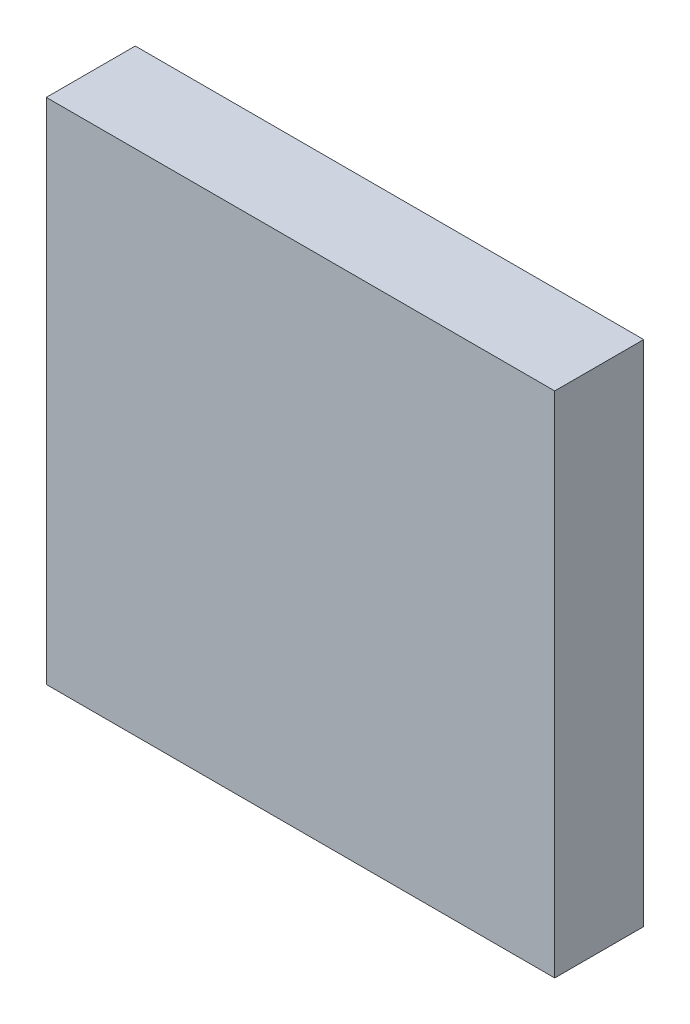
ISO-10303-21;
HEADER;
FILE_DESCRIPTION(('STEP AP214'),'2;1');
FILE_NAME('part.step','',(''),(''),'','','');
FILE_SCHEMA(('AUTOMOTIVE_DESIGN { 1 0 10303 214 1 1 1 1 }'));
ENDSEC;
DATA;
#1=APPLICATION_CONTEXT('core data for automotive mechanical design processes');
#2=APPLICATION_PROTOCOL_DEFINITION('international standard','automotive_design',2000,#1);
#3=PRODUCT_CONTEXT('',#1,'mechanical');
#4=PRODUCT('Part','Part','',(#3));
#5=PRODUCT_RELATED_PRODUCT_CATEGORY('part','',(#4));
#6=PRODUCT_DEFINITION_FORMATION('','',#4);
#7=PRODUCT_DEFINITION_CONTEXT('part definition',#1,'design');
#8=PRODUCT_DEFINITION('design','',#6,#7);
#9=PRODUCT_DEFINITION_SHAPE('','',#8);
#10=(LENGTH_UNIT() NAMED_UNIT(*) SI_UNIT(.MILLI.,.METRE.));
#11=(NAMED_UNIT(*) PLANE_ANGLE_UNIT() SI_UNIT($,.RADIAN.));
#12=(NAMED_UNIT(*) SI_UNIT($,.STERADIAN.) SOLID_ANGLE_UNIT());
#13=UNCERTAINTY_MEASURE_WITH_UNIT(LENGTH_MEASURE(1.E-05),#10,'distance_accuracy_value','');
#14=(GEOMETRIC_REPRESENTATION_CONTEXT(3) GLOBAL_UNCERTAINTY_ASSIGNED_CONTEXT((#13)) GLOBAL_UNIT_ASSIGNED_CONTEXT((#10,
#11,#12)) REPRESENTATION_CONTEXT('',''));
#15=CARTESIAN_POINT('',(0.,0.,0.));
#16=DIRECTION('',(0.,0.,1.));
#17=DIRECTION('',(1.,0.,0.));
#18=AXIS2_PLACEMENT_3D('',#15,#16,#17);
#19=CARTESIAN_POINT('',(-1000.,-1.11022302462516E-13,300.));
#20=DIRECTION('',(1.,0.,0.));
#21=DIRECTION('',(0.,1.,0.));
#22=AXIS2_PLACEMENT_3D('',#19,#20,#21);
#23=PLANE('',#22);
#24=DIRECTION('',(0.,-1.,0.));
#25=VECTOR('',#24,1.);
#26=CARTESIAN_POINT('',(-1000.,-1.11022302462516E-13,0.));
#27=LINE('',#26,#25);
#28=CARTESIAN_POINT('',(-1000.,1000.,0.));
#29=VERTEX_POINT('',#28);
#30=CARTESIAN_POINT('',(-999.999999999999,-1000.,0.));
#31=VERTEX_POINT('',#30);
#32=EDGE_CURVE('E408',#29,#31,#27,.T.);
#33=ORIENTED_EDGE('',*,*,#32,.T.);
#34=DIRECTION('',(0.,0.,-1.));
#35=VECTOR('',#34,1.);
#36=CARTESIAN_POINT('',(-999.999999999999,-1000.,300.));
#37=LINE('',#36,#35);
#38=CARTESIAN_POINT('',(-999.999999999999,-1000.,350.));
#39=VERTEX_POINT('',#38);
#40=EDGE_CURVE('E420',#39,#31,#37,.T.);
#41=ORIENTED_EDGE('',*,*,#40,.F.);
#42=DIRECTION('',(0.,-1.,0.));
#43=VECTOR('',#42,1.);
#44=CARTESIAN_POINT('',(-1000.,1000.,350.));
#45=LINE('',#44,#43);
#46=CARTESIAN_POINT('',(-1000.,1000.,350.));
#47=VERTEX_POINT('',#46);
#48=EDGE_CURVE('E300',#47,#39,#45,.T.);
#49=ORIENTED_EDGE('',*,*,#48,.F.);
#50=DIRECTION('',(0.,0.,-1.));
#51=VECTOR('',#50,1.);
#52=CARTESIAN_POINT('',(-1000.,1000.,300.));
#53=LINE('',#52,#51);
#54=EDGE_CURVE('E295',#47,#29,#53,.T.);
#55=ORIENTED_EDGE('',*,*,#54,.T.);
#56=EDGE_LOOP('',(#33,#41,#49,#55));
#57=FACE_BOUND('',#56,.T.);
#58=ADVANCED_FACE('F91',(#57),#23,.F.);
#59=CARTESIAN_POINT('',(0.,-1000.,300.));
#60=DIRECTION('',(0.,1.,0.));
#61=DIRECTION('',(0.,0.,1.));
#62=AXIS2_PLACEMENT_3D('',#59,#60,#61);
#63=PLANE('',#62);
#64=DIRECTION('',(1.,0.,0.));
#65=VECTOR('',#64,1.);
#66=CARTESIAN_POINT('',(0.,-1000.,0.));
#67=LINE('',#66,#65);
#68=CARTESIAN_POINT('',(1000.,-1000.,0.));
#69=VERTEX_POINT('',#68);
#70=EDGE_CURVE('E412',#31,#69,#67,.T.);
#71=ORIENTED_EDGE('',*,*,#70,.T.);
#72=DIRECTION('',(0.,0.,-1.));
#73=VECTOR('',#72,1.);
#74=CARTESIAN_POINT('',(1000.,-1000.,300.));
#75=LINE('',#74,#73);
#76=CARTESIAN_POINT('',(1000.,-1000.,350.));
#77=VERTEX_POINT('',#76);
#78=EDGE_CURVE('E289',#77,#69,#75,.T.);
#79=ORIENTED_EDGE('',*,*,#78,.F.);
#80=DIRECTION('',(1.,0.,0.));
#81=VECTOR('',#80,1.);
#82=CARTESIAN_POINT('',(-999.999999999999,-1000.,350.));
#83=LINE('',#82,#81);
#84=EDGE_CURVE('E305',#39,#77,#83,.T.);
#85=ORIENTED_EDGE('',*,*,#84,.F.);
#86=ORIENTED_EDGE('',*,*,#40,.T.);
#87=EDGE_LOOP('',(#71,#79,#85,#86));
#88=FACE_BOUND('',#87,.T.);
#89=ADVANCED_FACE('F697',(#88),#63,.F.);
#90=CARTESIAN_POINT('',(1000.,1.11022302462516E-13,300.));
#91=DIRECTION('',(1.,0.,0.));
#92=DIRECTION('',(0.,1.,0.));
#93=AXIS2_PLACEMENT_3D('',#90,#91,#92);
#94=PLANE('',#93);
#95=DIRECTION('',(0.,-1.,0.));
#96=VECTOR('',#95,1.);
#97=CARTESIAN_POINT('',(1000.,1.11022302462516E-13,0.));
#98=LINE('',#97,#96);
#99=CARTESIAN_POINT('',(1000.,1000.,0.));
#100=VERTEX_POINT('',#99);
#101=EDGE_CURVE('E284',#100,#69,#98,.T.);
#102=ORIENTED_EDGE('',*,*,#101,.F.);
#103=DIRECTION('',(0.,0.,-1.));
#104=VECTOR('',#103,1.);
#105=CARTESIAN_POINT('',(1000.,1000.,300.));
#106=LINE('',#105,#104);
#107=CARTESIAN_POINT('',(1000.,1000.,350.));
#108=VERTEX_POINT('',#107);
#109=EDGE_CURVE('E278',#108,#100,#106,.T.);
#110=ORIENTED_EDGE('',*,*,#109,.F.);
#111=DIRECTION('',(0.,1.,0.));
#112=VECTOR('',#111,1.);
#113=CARTESIAN_POINT('',(1000.,-1000.,350.));
#114=LINE('',#113,#112);
#115=EDGE_CURVE('E282',#77,#108,#114,.T.);
#116=ORIENTED_EDGE('',*,*,#115,.F.);
#117=ORIENTED_EDGE('',*,*,#78,.T.);
#118=EDGE_LOOP('',(#102,#110,#116,#117));
#119=FACE_BOUND('',#118,.T.);
#120=ADVANCED_FACE('F280',(#119),#94,.T.);
#121=CARTESIAN_POINT('',(0.,1000.,300.));
#122=DIRECTION('',(0.,1.,0.));
#123=DIRECTION('',(0.,0.,1.));
#124=AXIS2_PLACEMENT_3D('',#121,#122,#123);
#125=PLANE('',#124);
#126=DIRECTION('',(1.,0.,0.));
#127=VECTOR('',#126,1.);
#128=CARTESIAN_POINT('',(0.,1000.,0.));
#129=LINE('',#128,#127);
#130=EDGE_CURVE('E405',#29,#100,#129,.T.);
#131=ORIENTED_EDGE('',*,*,#130,.F.);
#132=ORIENTED_EDGE('',*,*,#54,.F.);
#133=DIRECTION('',(-1.,0.,0.));
#134=VECTOR('',#133,1.);
#135=CARTESIAN_POINT('',(1000.,1000.,350.));
#136=LINE('',#135,#134);
#137=EDGE_CURVE('E293',#108,#47,#136,.T.);
#138=ORIENTED_EDGE('',*,*,#137,.F.);
#139=ORIENTED_EDGE('',*,*,#109,.T.);
#140=EDGE_LOOP('',(#131,#132,#138,#139));
#141=FACE_BOUND('',#140,.T.);
#142=ADVANCED_FACE('F294',(#141),#125,.T.);
#143=CARTESIAN_POINT('',(950.,1.11022302462516E-13,300.));
#144=DIRECTION('',(1.,0.,0.));
#145=DIRECTION('',(0.,1.,0.));
#146=AXIS2_PLACEMENT_3D('',#143,#144,#145);
#147=PLANE('',#146);
#148=DIRECTION('',(0.,-1.,0.));
#149=VECTOR('',#148,1.);
#150=CARTESIAN_POINT('',(950.,1.11022302462516E-13,0.));
#151=LINE('',#150,#149);
#152=CARTESIAN_POINT('',(950.,950.,0.));
#153=VERTEX_POINT('',#152);
#154=CARTESIAN_POINT('',(950.,650.,0.));
#155=VERTEX_POINT('',#154);
#156=EDGE_CURVE('E398',#153,#155,#151,.T.);
#157=ORIENTED_EDGE('',*,*,#156,.T.);
#158=DIRECTION('',(0.,0.,-1.));
#159=VECTOR('',#158,1.);
#160=CARTESIAN_POINT('',(950.,650.,300.));
#161=LINE('',#160,#159);
#162=CARTESIAN_POINT('',(950.,650.,300.));
#163=VERTEX_POINT('',#162);
#164=EDGE_CURVE('E434',#163,#155,#161,.T.);
#165=ORIENTED_EDGE('',*,*,#164,.F.);
#166=DIRECTION('',(0.,-1.,0.));
#167=VECTOR('',#166,1.);
#168=CARTESIAN_POINT('',(950.,1.11022302462516E-13,300.));
#169=LINE('',#168,#167);
#170=CARTESIAN_POINT('',(950.,950.,300.));
#171=VERTEX_POINT('',#170);
#172=EDGE_CURVE('E350',#171,#163,#169,.T.);
#173=ORIENTED_EDGE('',*,*,#172,.F.);
#174=DIRECTION('',(0.,0.,-1.));
#175=VECTOR('',#174,1.);
#176=CARTESIAN_POINT('',(950.,950.,300.));
#177=LINE('',#176,#175);
#178=EDGE_CURVE('E290',#171,#153,#177,.T.);
#179=ORIENTED_EDGE('',*,*,#178,.T.);
#180=EDGE_LOOP('',(#157,#165,#173,#179));
#181=FACE_BOUND('',#180,.T.);
#182=ADVANCED_FACE('F547',(#181),#147,.F.);
#183=CARTESIAN_POINT('',(0.,650.,300.));
#184=DIRECTION('',(0.,1.,0.));
#185=DIRECTION('',(0.,0.,1.));
#186=AXIS2_PLACEMENT_3D('',#183,#184,#185);
#187=PLANE('',#186);
#188=DIRECTION('',(1.,0.,0.));
#189=VECTOR('',#188,1.);
#190=CARTESIAN_POINT('',(0.,650.,0.));
#191=LINE('',#190,#189);
#192=CARTESIAN_POINT('',(-950.,650.,0.));
#193=VERTEX_POINT('',#192);
#194=EDGE_CURVE('E400',#193,#155,#191,.T.);
#195=ORIENTED_EDGE('',*,*,#194,.F.);
#196=DIRECTION('',(0.,0.,-1.));
#197=VECTOR('',#196,1.);
#198=CARTESIAN_POINT('',(-950.,650.,300.));
#199=LINE('',#198,#197);
#200=CARTESIAN_POINT('',(-950.,650.,300.));
#201=VERTEX_POINT('',#200);
#202=EDGE_CURVE('E430',#201,#193,#199,.T.);
#203=ORIENTED_EDGE('',*,*,#202,.F.);
#204=DIRECTION('',(1.,0.,0.));
#205=VECTOR('',#204,1.);
#206=CARTESIAN_POINT('',(0.,650.,300.));
#207=LINE('',#206,#205);
#208=EDGE_CURVE('E352',#201,#163,#207,.T.);
#209=ORIENTED_EDGE('',*,*,#208,.T.);
#210=ORIENTED_EDGE('',*,*,#164,.T.);
#211=EDGE_LOOP('',(#195,#203,#209,#210));
#212=FACE_BOUND('',#211,.T.);
#213=ADVANCED_FACE('F558',(#212),#187,.T.);
#214=CARTESIAN_POINT('',(-950.,-1.11022302462516E-13,300.));
#215=DIRECTION('',(1.,0.,0.));
#216=DIRECTION('',(0.,1.,0.));
#217=AXIS2_PLACEMENT_3D('',#214,#215,#216);
#218=PLANE('',#217);
#219=DIRECTION('',(0.,-1.,0.));
#220=VECTOR('',#219,1.);
#221=CARTESIAN_POINT('',(-950.,-1.11022302462516E-13,0.));
#222=LINE('',#221,#220);
#223=CARTESIAN_POINT('',(-950.,950.,0.));
#224=VERTEX_POINT('',#223);
#225=EDGE_CURVE('E404',#224,#193,#222,.T.);
#226=ORIENTED_EDGE('',*,*,#225,.F.);
#227=DIRECTION('',(0.,0.,-1.));
#228=VECTOR('',#227,1.);
#229=CARTESIAN_POINT('',(-950.,950.,300.));
#230=LINE('',#229,#228);
#231=CARTESIAN_POINT('',(-950.,950.,300.));
#232=VERTEX_POINT('',#231);
#233=EDGE_CURVE('E427',#232,#224,#230,.T.);
#234=ORIENTED_EDGE('',*,*,#233,.F.);
#235=DIRECTION('',(0.,-1.,0.));
#236=VECTOR('',#235,1.);
#237=CARTESIAN_POINT('',(-950.,-1.11022302462516E-13,300.));
#238=LINE('',#237,#236);
#239=EDGE_CURVE('E356',#232,#201,#238,.T.);
#240=ORIENTED_EDGE('',*,*,#239,.T.);
#241=ORIENTED_EDGE('',*,*,#202,.T.);
#242=EDGE_LOOP('',(#226,#234,#240,#241));
#243=FACE_BOUND('',#242,.T.);
#244=ADVANCED_FACE('F595',(#243),#218,.T.);
#245=CARTESIAN_POINT('',(0.,950.,300.));
#246=DIRECTION('',(0.,1.,0.));
#247=DIRECTION('',(0.,0.,1.));
#248=AXIS2_PLACEMENT_3D('',#245,#246,#247);
#249=PLANE('',#248);
#250=DIRECTION('',(1.,0.,0.));
#251=VECTOR('',#250,1.);
#252=CARTESIAN_POINT('',(0.,950.,0.));
#253=LINE('',#252,#251);
#254=EDGE_CURVE('E394',#224,#153,#253,.T.);
#255=ORIENTED_EDGE('',*,*,#254,.T.);
#256=ORIENTED_EDGE('',*,*,#178,.F.);
#257=DIRECTION('',(1.,0.,0.));
#258=VECTOR('',#257,1.);
#259=CARTESIAN_POINT('',(0.,950.,300.));
#260=LINE('',#259,#258);
#261=EDGE_CURVE('E347',#232,#171,#260,.T.);
#262=ORIENTED_EDGE('',*,*,#261,.F.);
#263=ORIENTED_EDGE('',*,*,#233,.T.);
#264=EDGE_LOOP('',(#255,#256,#262,#263));
#265=FACE_BOUND('',#264,.T.);
#266=ADVANCED_FACE('F597',(#265),#249,.F.);
#267=CARTESIAN_POINT('',(950.,-100.024,0.));
#268=VERTEX_POINT('',#267);
#269=CARTESIAN_POINT('',(950.,-400.036,0.));
#270=VERTEX_POINT('',#269);
#271=EDGE_CURVE('E393',#268,#270,#151,.T.);
#272=ORIENTED_EDGE('',*,*,#271,.T.);
#273=DIRECTION('',(0.,0.,1.));
#274=VECTOR('',#273,1.);
#275=CARTESIAN_POINT('',(950.,-400.036,300.));
#276=LINE('',#275,#274);
#277=CARTESIAN_POINT('',(950.,-400.036,300.));
#278=VERTEX_POINT('',#277);
#279=EDGE_CURVE('E101',#270,#278,#276,.T.);
#280=ORIENTED_EDGE('',*,*,#279,.T.);
#281=CARTESIAN_POINT('',(950.,-100.024,300.));
#282=VERTEX_POINT('',#281);
#283=EDGE_CURVE('E346',#282,#278,#169,.T.);
#284=ORIENTED_EDGE('',*,*,#283,.F.);
#285=DIRECTION('',(0.,0.,-1.));
#286=VECTOR('',#285,1.);
#287=CARTESIAN_POINT('',(950.,-100.024,300.));
#288=LINE('',#287,#286);
#289=EDGE_CURVE('E431',#282,#268,#288,.T.);
#290=ORIENTED_EDGE('',*,*,#289,.T.);
#291=EDGE_LOOP('',(#272,#280,#284,#290));
#292=FACE_BOUND('',#291,.T.);
#293=ADVANCED_FACE('F599',(#292),#147,.F.);
#294=CARTESIAN_POINT('',(950.,-450.036,300.));
#295=VERTEX_POINT('',#294);
#296=CARTESIAN_POINT('',(950.,-750.048,300.));
#297=VERTEX_POINT('',#296);
#298=EDGE_CURVE('E565',#295,#297,#169,.T.);
#299=ORIENTED_EDGE('',*,*,#298,.F.);
#300=DIRECTION('',(0.,0.,-1.));
#301=VECTOR('',#300,1.);
#302=CARTESIAN_POINT('',(950.000000000011,-450.036,300.));
#303=LINE('',#302,#301);
#304=CARTESIAN_POINT('',(950.,-450.036,0.));
#305=VERTEX_POINT('',#304);
#306=EDGE_CURVE('E12',#295,#305,#303,.T.);
#307=ORIENTED_EDGE('',*,*,#306,.T.);
#308=CARTESIAN_POINT('',(950.,-750.048,0.));
#309=VERTEX_POINT('',#308);
#310=EDGE_CURVE('E531',#305,#309,#151,.T.);
#311=ORIENTED_EDGE('',*,*,#310,.T.);
#312=DIRECTION('',(0.,0.,1.));
#313=VECTOR('',#312,1.);
#314=CARTESIAN_POINT('',(950.,-750.048,300.));
#315=LINE('',#314,#313);
#316=EDGE_CURVE('E493',#309,#297,#315,.T.);
#317=ORIENTED_EDGE('',*,*,#316,.T.);
#318=EDGE_LOOP('',(#299,#307,#311,#317));
#319=FACE_BOUND('',#318,.T.);
#320=ADVANCED_FACE('F537',(#319),#147,.F.);
#321=CARTESIAN_POINT('',(950.,-800.048,300.));
#322=VERTEX_POINT('',#321);
#323=CARTESIAN_POINT('',(950.,-950.,300.));
#324=VERTEX_POINT('',#323);
#325=EDGE_CURVE('E321',#322,#324,#169,.T.);
#326=ORIENTED_EDGE('',*,*,#325,.F.);
#327=DIRECTION('',(0.,0.,-1.));
#328=VECTOR('',#327,1.);
#329=CARTESIAN_POINT('',(950.000000000015,-800.048,300.));
#330=LINE('',#329,#328);
#331=CARTESIAN_POINT('',(950.,-800.048,0.));
#332=VERTEX_POINT('',#331);
#333=EDGE_CURVE('E95',#322,#332,#330,.T.);
#334=ORIENTED_EDGE('',*,*,#333,.T.);
#335=CARTESIAN_POINT('',(950.,-950.,0.));
#336=VERTEX_POINT('',#335);
#337=EDGE_CURVE('E366',#332,#336,#151,.T.);
#338=ORIENTED_EDGE('',*,*,#337,.T.);
#339=DIRECTION('',(0.,0.,-1.));
#340=VECTOR('',#339,1.);
#341=CARTESIAN_POINT('',(950.,-950.,300.));
#342=LINE('',#341,#340);
#343=EDGE_CURVE('E448',#324,#336,#342,.T.);
#344=ORIENTED_EDGE('',*,*,#343,.F.);
#345=EDGE_LOOP('',(#326,#334,#338,#344));
#346=FACE_BOUND('',#345,.T.);
#347=ADVANCED_FACE('F577',(#346),#147,.F.);
#348=CARTESIAN_POINT('',(0.,-950.,300.));
#349=DIRECTION('',(0.,1.,0.));
#350=DIRECTION('',(0.,0.,1.));
#351=AXIS2_PLACEMENT_3D('',#348,#349,#350);
#352=PLANE('',#351);
#353=DIRECTION('',(1.,0.,0.));
#354=VECTOR('',#353,1.);
#355=CARTESIAN_POINT('',(0.,-950.,0.));
#356=LINE('',#355,#354);
#357=CARTESIAN_POINT('',(-950.,-950.,0.));
#358=VERTEX_POINT('',#357);
#359=EDGE_CURVE('E389',#358,#336,#356,.T.);
#360=ORIENTED_EDGE('',*,*,#359,.F.);
#361=DIRECTION('',(0.,0.,-1.));
#362=VECTOR('',#361,1.);
#363=CARTESIAN_POINT('',(-950.,-950.,300.));
#364=LINE('',#363,#362);
#365=CARTESIAN_POINT('',(-950.,-950.,300.));
#366=VERTEX_POINT('',#365);
#367=EDGE_CURVE('E443',#366,#358,#364,.T.);
#368=ORIENTED_EDGE('',*,*,#367,.F.);
#369=DIRECTION('',(1.,0.,0.));
#370=VECTOR('',#369,1.);
#371=CARTESIAN_POINT('',(0.,-950.,300.));
#372=LINE('',#371,#370);
#373=EDGE_CURVE('E342',#366,#324,#372,.T.);
#374=ORIENTED_EDGE('',*,*,#373,.T.);
#375=ORIENTED_EDGE('',*,*,#343,.T.);
#376=EDGE_LOOP('',(#360,#368,#374,#375));
#377=FACE_BOUND('',#376,.T.);
#378=ADVANCED_FACE('F582',(#377),#352,.T.);
#379=CARTESIAN_POINT('',(-950.,-800.048,0.));
#380=VERTEX_POINT('',#379);
#381=EDGE_CURVE('E376',#380,#358,#222,.T.);
#382=ORIENTED_EDGE('',*,*,#381,.F.);
#383=DIRECTION('',(0.,0.,1.));
#384=VECTOR('',#383,1.);
#385=CARTESIAN_POINT('',(-950.,-800.048,300.));
#386=LINE('',#385,#384);
#387=CARTESIAN_POINT('',(-950.,-800.048,300.));
#388=VERTEX_POINT('',#387);
#389=EDGE_CURVE('E482',#380,#388,#386,.T.);
#390=ORIENTED_EDGE('',*,*,#389,.T.);
#391=EDGE_CURVE('E331',#388,#366,#238,.T.);
#392=ORIENTED_EDGE('',*,*,#391,.T.);
#393=ORIENTED_EDGE('',*,*,#367,.T.);
#394=EDGE_LOOP('',(#382,#390,#392,#393));
#395=FACE_BOUND('',#394,.T.);
#396=ADVANCED_FACE('F585',(#395),#218,.T.);
#397=CARTESIAN_POINT('',(-950.,-450.036,0.));
#398=VERTEX_POINT('',#397);
#399=CARTESIAN_POINT('',(-950.,-750.048,0.));
#400=VERTEX_POINT('',#399);
#401=EDGE_CURVE('E533',#398,#400,#222,.T.);
#402=ORIENTED_EDGE('',*,*,#401,.F.);
#403=DIRECTION('',(0.,0.,1.));
#404=VECTOR('',#403,1.);
#405=CARTESIAN_POINT('',(-950.,-450.036,300.));
#406=LINE('',#405,#404);
#407=CARTESIAN_POINT('',(-950.,-450.036,300.));
#408=VERTEX_POINT('',#407);
#409=EDGE_CURVE('E489',#398,#408,#406,.T.);
#410=ORIENTED_EDGE('',*,*,#409,.T.);
#411=CARTESIAN_POINT('',(-950.,-750.048,300.));
#412=VERTEX_POINT('',#411);
#413=EDGE_CURVE('E587',#408,#412,#238,.T.);
#414=ORIENTED_EDGE('',*,*,#413,.T.);
#415=DIRECTION('',(0.,0.,1.));
#416=VECTOR('',#415,1.);
#417=CARTESIAN_POINT('',(-950.,-750.048,300.));
#418=LINE('',#417,#416);
#419=EDGE_CURVE('E426',#400,#412,#418,.T.);
#420=ORIENTED_EDGE('',*,*,#419,.F.);
#421=EDGE_LOOP('',(#402,#410,#414,#420));
#422=FACE_BOUND('',#421,.T.);
#423=ADVANCED_FACE('F609',(#422),#218,.T.);
#424=DIRECTION('',(0.,0.,1.));
#425=VECTOR('',#424,1.);
#426=CARTESIAN_POINT('',(-950.,-400.036,300.));
#427=LINE('',#426,#425);
#428=CARTESIAN_POINT('',(-950.,-400.036,0.));
#429=VERTEX_POINT('',#428);
#430=CARTESIAN_POINT('',(-950.,-400.036,300.));
#431=VERTEX_POINT('',#430);
#432=EDGE_CURVE('E486',#429,#431,#427,.T.);
#433=ORIENTED_EDGE('',*,*,#432,.F.);
#434=CARTESIAN_POINT('',(-950.,-100.024,0.));
#435=VERTEX_POINT('',#434);
#436=EDGE_CURVE('E399',#435,#429,#222,.T.);
#437=ORIENTED_EDGE('',*,*,#436,.F.);
#438=DIRECTION('',(0.,0.,-1.));
#439=VECTOR('',#438,1.);
#440=CARTESIAN_POINT('',(-950.,-100.024,300.));
#441=LINE('',#440,#439);
#442=CARTESIAN_POINT('',(-950.,-100.024,300.));
#443=VERTEX_POINT('',#442);
#444=EDGE_CURVE('E440',#443,#435,#441,.T.);
#445=ORIENTED_EDGE('',*,*,#444,.F.);
#446=EDGE_CURVE('E351',#443,#431,#238,.T.);
#447=ORIENTED_EDGE('',*,*,#446,.T.);
#448=EDGE_LOOP('',(#433,#437,#445,#447));
#449=FACE_BOUND('',#448,.T.);
#450=ADVANCED_FACE('F610',(#449),#218,.T.);
#451=CARTESIAN_POINT('',(0.,-100.024,300.));
#452=DIRECTION('',(0.,1.,0.));
#453=DIRECTION('',(0.,0.,1.));
#454=AXIS2_PLACEMENT_3D('',#451,#452,#453);
#455=PLANE('',#454);
#456=DIRECTION('',(1.,0.,0.));
#457=VECTOR('',#456,1.);
#458=CARTESIAN_POINT('',(0.,-100.024,0.));
#459=LINE('',#458,#457);
#460=EDGE_CURVE('E385',#435,#268,#459,.T.);
#461=ORIENTED_EDGE('',*,*,#460,.T.);
#462=ORIENTED_EDGE('',*,*,#289,.F.);
#463=DIRECTION('',(1.,0.,0.));
#464=VECTOR('',#463,1.);
#465=CARTESIAN_POINT('',(0.,-100.024,300.));
#466=LINE('',#465,#464);
#467=EDGE_CURVE('E339',#443,#282,#466,.T.);
#468=ORIENTED_EDGE('',*,*,#467,.F.);
#469=ORIENTED_EDGE('',*,*,#444,.T.);
#470=EDGE_LOOP('',(#461,#462,#468,#469));
#471=FACE_BOUND('',#470,.T.);
#472=ADVANCED_FACE('F721',(#471),#455,.F.);
#473=CARTESIAN_POINT('',(950.,249.988,0.));
#474=VERTEX_POINT('',#473);
#475=CARTESIAN_POINT('',(950.,-50.0240000000001,0.));
#476=VERTEX_POINT('',#475);
#477=EDGE_CURVE('E367',#474,#476,#151,.T.);
#478=ORIENTED_EDGE('',*,*,#477,.T.);
#479=DIRECTION('',(0.,0.,-1.));
#480=VECTOR('',#479,1.);
#481=CARTESIAN_POINT('',(950.,-50.0240000000001,300.));
#482=LINE('',#481,#480);
#483=CARTESIAN_POINT('',(950.,-50.0240000000001,300.));
#484=VERTEX_POINT('',#483);
#485=EDGE_CURVE('E462',#484,#476,#482,.T.);
#486=ORIENTED_EDGE('',*,*,#485,.F.);
#487=CARTESIAN_POINT('',(950.,249.988,300.));
#488=VERTEX_POINT('',#487);
#489=EDGE_CURVE('E322',#488,#484,#169,.T.);
#490=ORIENTED_EDGE('',*,*,#489,.F.);
#491=DIRECTION('',(0.,0.,-1.));
#492=VECTOR('',#491,1.);
#493=CARTESIAN_POINT('',(950.,249.988,300.));
#494=LINE('',#493,#492);
#495=EDGE_CURVE('E444',#488,#474,#494,.T.);
#496=ORIENTED_EDGE('',*,*,#495,.T.);
#497=EDGE_LOOP('',(#478,#486,#490,#496));
#498=FACE_BOUND('',#497,.T.);
#499=ADVANCED_FACE('F607',(#498),#147,.F.);
#500=CARTESIAN_POINT('',(0.,-50.0240000000001,300.));
#501=DIRECTION('',(0.,1.,0.));
#502=DIRECTION('',(0.,0.,1.));
#503=AXIS2_PLACEMENT_3D('',#500,#501,#502);
#504=PLANE('',#503);
#505=DIRECTION('',(1.,0.,0.));
#506=VECTOR('',#505,1.);
#507=CARTESIAN_POINT('',(0.,-50.0240000000001,0.));
#508=LINE('',#507,#506);
#509=CARTESIAN_POINT('',(-950.,-50.0240000000001,0.));
#510=VERTEX_POINT('',#509);
#511=EDGE_CURVE('E381',#510,#476,#508,.T.);
#512=ORIENTED_EDGE('',*,*,#511,.F.);
#513=DIRECTION('',(0.,0.,-1.));
#514=VECTOR('',#513,1.);
#515=CARTESIAN_POINT('',(-950.,-50.0240000000001,300.));
#516=LINE('',#515,#514);
#517=CARTESIAN_POINT('',(-950.,-50.0240000000001,300.));
#518=VERTEX_POINT('',#517);
#519=EDGE_CURVE('E458',#518,#510,#516,.T.);
#520=ORIENTED_EDGE('',*,*,#519,.F.);
#521=DIRECTION('',(1.,0.,0.));
#522=VECTOR('',#521,1.);
#523=CARTESIAN_POINT('',(0.,-50.0240000000001,300.));
#524=LINE('',#523,#522);
#525=EDGE_CURVE('E335',#518,#484,#524,.T.);
#526=ORIENTED_EDGE('',*,*,#525,.T.);
#527=ORIENTED_EDGE('',*,*,#485,.T.);
#528=EDGE_LOOP('',(#512,#520,#526,#527));
#529=FACE_BOUND('',#528,.T.);
#530=ADVANCED_FACE('F645',(#529),#504,.T.);
#531=CARTESIAN_POINT('',(-950.,249.988,0.));
#532=VERTEX_POINT('',#531);
#533=EDGE_CURVE('E377',#532,#510,#222,.T.);
#534=ORIENTED_EDGE('',*,*,#533,.F.);
#535=DIRECTION('',(0.,0.,-1.));
#536=VECTOR('',#535,1.);
#537=CARTESIAN_POINT('',(-950.,249.988,300.));
#538=LINE('',#537,#536);
#539=CARTESIAN_POINT('',(-950.,249.988,300.));
#540=VERTEX_POINT('',#539);
#541=EDGE_CURVE('E455',#540,#532,#538,.T.);
#542=ORIENTED_EDGE('',*,*,#541,.F.);
#543=EDGE_CURVE('E332',#540,#518,#238,.T.);
#544=ORIENTED_EDGE('',*,*,#543,.T.);
#545=ORIENTED_EDGE('',*,*,#519,.T.);
#546=EDGE_LOOP('',(#534,#542,#544,#545));
#547=FACE_BOUND('',#546,.T.);
#548=ADVANCED_FACE('F636',(#547),#218,.T.);
#549=CARTESIAN_POINT('',(0.,249.988,300.));
#550=DIRECTION('',(0.,1.,0.));
#551=DIRECTION('',(0.,0.,1.));
#552=AXIS2_PLACEMENT_3D('',#549,#550,#551);
#553=PLANE('',#552);
#554=DIRECTION('',(1.,0.,0.));
#555=VECTOR('',#554,1.);
#556=CARTESIAN_POINT('',(0.,249.988,0.));
#557=LINE('',#556,#555);
#558=EDGE_CURVE('E375',#532,#474,#557,.T.);
#559=ORIENTED_EDGE('',*,*,#558,.T.);
#560=ORIENTED_EDGE('',*,*,#495,.F.);
#561=DIRECTION('',(1.,0.,0.));
#562=VECTOR('',#561,1.);
#563=CARTESIAN_POINT('',(0.,249.988,300.));
#564=LINE('',#563,#562);
#565=EDGE_CURVE('E330',#540,#488,#564,.T.);
#566=ORIENTED_EDGE('',*,*,#565,.F.);
#567=ORIENTED_EDGE('',*,*,#541,.T.);
#568=EDGE_LOOP('',(#559,#560,#566,#567));
#569=FACE_BOUND('',#568,.T.);
#570=ADVANCED_FACE('F656',(#569),#553,.F.);
#571=CARTESIAN_POINT('',(950.,600.,0.));
#572=VERTEX_POINT('',#571);
#573=CARTESIAN_POINT('',(950.,299.988,0.));
#574=VERTEX_POINT('',#573);
#575=EDGE_CURVE('E361',#572,#574,#151,.T.);
#576=ORIENTED_EDGE('',*,*,#575,.T.);
#577=DIRECTION('',(0.,0.,-1.));
#578=VECTOR('',#577,1.);
#579=CARTESIAN_POINT('',(950.,299.988,300.));
#580=LINE('',#579,#578);
#581=CARTESIAN_POINT('',(950.,299.988,300.));
#582=VERTEX_POINT('',#581);
#583=EDGE_CURVE('E474',#582,#574,#580,.T.);
#584=ORIENTED_EDGE('',*,*,#583,.F.);
#585=CARTESIAN_POINT('',(950.,600.,300.));
#586=VERTEX_POINT('',#585);
#587=EDGE_CURVE('E317',#586,#582,#169,.T.);
#588=ORIENTED_EDGE('',*,*,#587,.F.);
#589=DIRECTION('',(0.,0.,-1.));
#590=VECTOR('',#589,1.);
#591=CARTESIAN_POINT('',(950.,600.,300.));
#592=LINE('',#591,#590);
#593=EDGE_CURVE('E459',#586,#572,#592,.T.);
#594=ORIENTED_EDGE('',*,*,#593,.T.);
#595=EDGE_LOOP('',(#576,#584,#588,#594));
#596=FACE_BOUND('',#595,.T.);
#597=ADVANCED_FACE('F658',(#596),#147,.F.);
#598=CARTESIAN_POINT('',(0.,299.988,300.));
#599=DIRECTION('',(0.,1.,0.));
#600=DIRECTION('',(0.,0.,1.));
#601=AXIS2_PLACEMENT_3D('',#598,#599,#600);
#602=PLANE('',#601);
#603=DIRECTION('',(1.,0.,0.));
#604=VECTOR('',#603,1.);
#605=CARTESIAN_POINT('',(0.,299.988,0.));
#606=LINE('',#605,#604);
#607=CARTESIAN_POINT('',(-950.,299.988,0.));
#608=VERTEX_POINT('',#607);
#609=EDGE_CURVE('E365',#608,#574,#606,.T.);
#610=ORIENTED_EDGE('',*,*,#609,.F.);
#611=DIRECTION('',(0.,0.,-1.));
#612=VECTOR('',#611,1.);
#613=CARTESIAN_POINT('',(-950.,299.988,300.));
#614=LINE('',#613,#612);
#615=CARTESIAN_POINT('',(-950.,299.988,300.));
#616=VERTEX_POINT('',#615);
#617=EDGE_CURVE('E471',#616,#608,#614,.T.);
#618=ORIENTED_EDGE('',*,*,#617,.F.);
#619=DIRECTION('',(1.,0.,0.));
#620=VECTOR('',#619,1.);
#621=CARTESIAN_POINT('',(0.,299.988,300.));
#622=LINE('',#621,#620);
#623=EDGE_CURVE('E320',#616,#582,#622,.T.);
#624=ORIENTED_EDGE('',*,*,#623,.T.);
#625=ORIENTED_EDGE('',*,*,#583,.T.);
#626=EDGE_LOOP('',(#610,#618,#624,#625));
#627=FACE_BOUND('',#626,.T.);
#628=ADVANCED_FACE('F664',(#627),#602,.T.);
#629=CARTESIAN_POINT('',(-950.,600.,0.));
#630=VERTEX_POINT('',#629);
#631=EDGE_CURVE('E371',#630,#608,#222,.T.);
#632=ORIENTED_EDGE('',*,*,#631,.F.);
#633=DIRECTION('',(0.,0.,-1.));
#634=VECTOR('',#633,1.);
#635=CARTESIAN_POINT('',(-950.,600.,300.));
#636=LINE('',#635,#634);
#637=CARTESIAN_POINT('',(-950.,600.,300.));
#638=VERTEX_POINT('',#637);
#639=EDGE_CURVE('E468',#638,#630,#636,.T.);
#640=ORIENTED_EDGE('',*,*,#639,.F.);
#641=EDGE_CURVE('E326',#638,#616,#238,.T.);
#642=ORIENTED_EDGE('',*,*,#641,.T.);
#643=ORIENTED_EDGE('',*,*,#617,.T.);
#644=EDGE_LOOP('',(#632,#640,#642,#643));
#645=FACE_BOUND('',#644,.T.);
#646=ADVANCED_FACE('F666',(#645),#218,.T.);
#647=CARTESIAN_POINT('',(0.,600.,300.));
#648=DIRECTION('',(0.,1.,0.));
#649=DIRECTION('',(0.,0.,1.));
#650=AXIS2_PLACEMENT_3D('',#647,#648,#649);
#651=PLANE('',#650);
#652=DIRECTION('',(1.,0.,0.));
#653=VECTOR('',#652,1.);
#654=CARTESIAN_POINT('',(0.,600.,0.));
#655=LINE('',#654,#653);
#656=EDGE_CURVE('E357',#630,#572,#655,.T.);
#657=ORIENTED_EDGE('',*,*,#656,.T.);
#658=ORIENTED_EDGE('',*,*,#593,.F.);
#659=DIRECTION('',(1.,0.,0.));
#660=VECTOR('',#659,1.);
#661=CARTESIAN_POINT('',(0.,600.,300.));
#662=LINE('',#661,#660);
#663=EDGE_CURVE('E314',#638,#586,#662,.T.);
#664=ORIENTED_EDGE('',*,*,#663,.F.);
#665=ORIENTED_EDGE('',*,*,#639,.T.);
#666=EDGE_LOOP('',(#657,#658,#664,#665));
#667=FACE_BOUND('',#666,.T.);
#668=ADVANCED_FACE('F621',(#667),#651,.F.);
#669=CARTESIAN_POINT('',(0.,0.,0.));
#670=DIRECTION('',(0.,0.,1.));
#671=DIRECTION('',(1.,0.,0.));
#672=AXIS2_PLACEMENT_3D('',#669,#670,#671);
#673=PLANE('',#672);
#674=ORIENTED_EDGE('',*,*,#337,.F.);
#675=DIRECTION('',(1.,0.,0.));
#676=VECTOR('',#675,1.);
#677=CARTESIAN_POINT('',(-949.999999999985,-800.048,0.));
#678=LINE('',#677,#676);
#679=EDGE_CURVE('E313',#380,#332,#678,.T.);
#680=ORIENTED_EDGE('',*,*,#679,.F.);
#681=ORIENTED_EDGE('',*,*,#381,.T.);
#682=ORIENTED_EDGE('',*,*,#359,.T.);
#683=EDGE_LOOP('',(#674,#680,#681,#682));
#684=FACE_BOUND('',#683,.T.);
#685=ORIENTED_EDGE('',*,*,#310,.F.);
#686=DIRECTION('',(1.,0.,0.));
#687=VECTOR('',#686,1.);
#688=CARTESIAN_POINT('',(-949.999999999989,-450.036,0.));
#689=LINE('',#688,#687);
#690=EDGE_CURVE('E506',#398,#305,#689,.T.);
#691=ORIENTED_EDGE('',*,*,#690,.F.);
#692=ORIENTED_EDGE('',*,*,#401,.T.);
#693=DIRECTION('',(1.,0.,0.));
#694=VECTOR('',#693,1.);
#695=CARTESIAN_POINT('',(-949.999999999985,-750.048,0.));
#696=LINE('',#695,#694);
#697=EDGE_CURVE('E516',#400,#309,#696,.T.);
#698=ORIENTED_EDGE('',*,*,#697,.T.);
#699=EDGE_LOOP('',(#685,#691,#692,#698));
#700=FACE_BOUND('',#699,.T.);
#701=ORIENTED_EDGE('',*,*,#656,.F.);
#702=ORIENTED_EDGE('',*,*,#631,.T.);
#703=ORIENTED_EDGE('',*,*,#609,.T.);
#704=ORIENTED_EDGE('',*,*,#575,.F.);
#705=EDGE_LOOP('',(#701,#702,#703,#704));
#706=FACE_BOUND('',#705,.T.);
#707=ORIENTED_EDGE('',*,*,#558,.F.);
#708=ORIENTED_EDGE('',*,*,#533,.T.);
#709=ORIENTED_EDGE('',*,*,#511,.T.);
#710=ORIENTED_EDGE('',*,*,#477,.F.);
#711=EDGE_LOOP('',(#707,#708,#709,#710));
#712=FACE_BOUND('',#711,.T.);
#713=ORIENTED_EDGE('',*,*,#460,.F.);
#714=ORIENTED_EDGE('',*,*,#436,.T.);
#715=DIRECTION('',(1.,0.,0.));
#716=VECTOR('',#715,1.);
#717=CARTESIAN_POINT('',(-949.999999999989,-400.036,0.));
#718=LINE('',#717,#716);
#719=EDGE_CURVE('E503',#429,#270,#718,.T.);
#720=ORIENTED_EDGE('',*,*,#719,.T.);
#721=ORIENTED_EDGE('',*,*,#271,.F.);
#722=EDGE_LOOP('',(#713,#714,#720,#721));
#723=FACE_BOUND('',#722,.T.);
#724=ORIENTED_EDGE('',*,*,#254,.F.);
#725=ORIENTED_EDGE('',*,*,#225,.T.);
#726=ORIENTED_EDGE('',*,*,#194,.T.);
#727=ORIENTED_EDGE('',*,*,#156,.F.);
#728=EDGE_LOOP('',(#724,#725,#726,#727));
#729=FACE_BOUND('',#728,.T.);
#730=ORIENTED_EDGE('',*,*,#130,.T.);
#731=ORIENTED_EDGE('',*,*,#101,.T.);
#732=ORIENTED_EDGE('',*,*,#70,.F.);
#733=ORIENTED_EDGE('',*,*,#32,.F.);
#734=EDGE_LOOP('',(#730,#731,#732,#733));
#735=FACE_BOUND('',#734,.T.);
#736=ADVANCED_FACE('F528',(#684,#700,#706,#712,#723,#729,#735),#673,.F.);
#737=CARTESIAN_POINT('',(-949.999999999985,-800.048,300.));
#738=DIRECTION('',(0.,1.,0.));
#739=DIRECTION('',(0.,0.,1.));
#740=AXIS2_PLACEMENT_3D('',#737,#738,#739);
#741=PLANE('',#740);
#742=ORIENTED_EDGE('',*,*,#679,.T.);
#743=ORIENTED_EDGE('',*,*,#333,.F.);
#744=DIRECTION('',(1.,0.,0.));
#745=VECTOR('',#744,1.);
#746=CARTESIAN_POINT('',(-949.999999999985,-800.048,300.));
#747=LINE('',#746,#745);
#748=EDGE_CURVE('E513',#388,#322,#747,.T.);
#749=ORIENTED_EDGE('',*,*,#748,.F.);
#750=ORIENTED_EDGE('',*,*,#389,.F.);
#751=EDGE_LOOP('',(#742,#743,#749,#750));
#752=FACE_BOUND('',#751,.T.);
#753=ADVANCED_FACE('F93',(#752),#741,.F.);
#754=CARTESIAN_POINT('',(-949.999999999985,-750.048,300.));
#755=DIRECTION('',(0.,1.,0.));
#756=DIRECTION('',(0.,0.,1.));
#757=AXIS2_PLACEMENT_3D('',#754,#755,#756);
#758=PLANE('',#757);
#759=ORIENTED_EDGE('',*,*,#697,.F.);
#760=ORIENTED_EDGE('',*,*,#419,.T.);
#761=DIRECTION('',(1.,0.,0.));
#762=VECTOR('',#761,1.);
#763=CARTESIAN_POINT('',(-949.999999999985,-750.048,300.));
#764=LINE('',#763,#762);
#765=EDGE_CURVE('E109',#412,#297,#764,.T.);
#766=ORIENTED_EDGE('',*,*,#765,.T.);
#767=ORIENTED_EDGE('',*,*,#316,.F.);
#768=EDGE_LOOP('',(#759,#760,#766,#767));
#769=FACE_BOUND('',#768,.T.);
#770=ADVANCED_FACE('F613',(#769),#758,.T.);
#771=CARTESIAN_POINT('',(-949.999999999989,-450.036,300.));
#772=DIRECTION('',(0.,1.,0.));
#773=DIRECTION('',(0.,0.,1.));
#774=AXIS2_PLACEMENT_3D('',#771,#772,#773);
#775=PLANE('',#774);
#776=ORIENTED_EDGE('',*,*,#690,.T.);
#777=ORIENTED_EDGE('',*,*,#306,.F.);
#778=DIRECTION('',(1.,0.,0.));
#779=VECTOR('',#778,1.);
#780=CARTESIAN_POINT('',(-949.999999999989,-450.036,300.));
#781=LINE('',#780,#779);
#782=EDGE_CURVE('E500',#408,#295,#781,.T.);
#783=ORIENTED_EDGE('',*,*,#782,.F.);
#784=ORIENTED_EDGE('',*,*,#409,.F.);
#785=EDGE_LOOP('',(#776,#777,#783,#784));
#786=FACE_BOUND('',#785,.T.);
#787=ADVANCED_FACE('F619',(#786),#775,.F.);
#788=CARTESIAN_POINT('',(-949.999999999989,-400.036,300.));
#789=DIRECTION('',(0.,1.,0.));
#790=DIRECTION('',(0.,0.,1.));
#791=AXIS2_PLACEMENT_3D('',#788,#789,#790);
#792=PLANE('',#791);
#793=ORIENTED_EDGE('',*,*,#719,.F.);
#794=ORIENTED_EDGE('',*,*,#432,.T.);
#795=DIRECTION('',(1.,0.,0.));
#796=VECTOR('',#795,1.);
#797=CARTESIAN_POINT('',(-949.999999999989,-400.036,300.));
#798=LINE('',#797,#796);
#799=EDGE_CURVE('E117',#431,#278,#798,.T.);
#800=ORIENTED_EDGE('',*,*,#799,.T.);
#801=ORIENTED_EDGE('',*,*,#279,.F.);
#802=EDGE_LOOP('',(#793,#794,#800,#801));
#803=FACE_BOUND('',#802,.T.);
#804=ADVANCED_FACE('F675',(#803),#792,.T.);
#805=CARTESIAN_POINT('',(0.,0.,300.));
#806=DIRECTION('',(0.,0.,1.));
#807=DIRECTION('',(1.,0.,0.));
#808=AXIS2_PLACEMENT_3D('',#805,#806,#807);
#809=PLANE('',#808);
#810=ORIENTED_EDGE('',*,*,#239,.F.);
#811=ORIENTED_EDGE('',*,*,#261,.T.);
#812=ORIENTED_EDGE('',*,*,#172,.T.);
#813=ORIENTED_EDGE('',*,*,#208,.F.);
#814=EDGE_LOOP('',(#810,#811,#812,#813));
#815=FACE_BOUND('',#814,.T.);
#816=ADVANCED_FACE('F561',(#815),#809,.F.);
#817=ORIENTED_EDGE('',*,*,#446,.F.);
#818=ORIENTED_EDGE('',*,*,#467,.T.);
#819=ORIENTED_EDGE('',*,*,#283,.T.);
#820=ORIENTED_EDGE('',*,*,#799,.F.);
#821=EDGE_LOOP('',(#817,#818,#819,#820));
#822=FACE_BOUND('',#821,.T.);
#823=ADVANCED_FACE('F736',(#822),#809,.F.);
#824=ORIENTED_EDGE('',*,*,#543,.F.);
#825=ORIENTED_EDGE('',*,*,#565,.T.);
#826=ORIENTED_EDGE('',*,*,#489,.T.);
#827=ORIENTED_EDGE('',*,*,#525,.F.);
#828=EDGE_LOOP('',(#824,#825,#826,#827));
#829=FACE_BOUND('',#828,.T.);
#830=ADVANCED_FACE('F641',(#829),#809,.F.);
#831=ORIENTED_EDGE('',*,*,#641,.F.);
#832=ORIENTED_EDGE('',*,*,#663,.T.);
#833=ORIENTED_EDGE('',*,*,#587,.T.);
#834=ORIENTED_EDGE('',*,*,#623,.F.);
#835=EDGE_LOOP('',(#831,#832,#833,#834));
#836=FACE_BOUND('',#835,.T.);
#837=ADVANCED_FACE('F686',(#836),#809,.F.);
#838=ORIENTED_EDGE('',*,*,#413,.F.);
#839=ORIENTED_EDGE('',*,*,#782,.T.);
#840=ORIENTED_EDGE('',*,*,#298,.T.);
#841=ORIENTED_EDGE('',*,*,#765,.F.);
#842=EDGE_LOOP('',(#838,#839,#840,#841));
#843=FACE_BOUND('',#842,.T.);
#844=ADVANCED_FACE('F684',(#843),#809,.F.);
#845=ORIENTED_EDGE('',*,*,#391,.F.);
#846=ORIENTED_EDGE('',*,*,#748,.T.);
#847=ORIENTED_EDGE('',*,*,#325,.T.);
#848=ORIENTED_EDGE('',*,*,#373,.F.);
#849=EDGE_LOOP('',(#845,#846,#847,#848));
#850=FACE_BOUND('',#849,.T.);
#851=ADVANCED_FACE('F572',(#850),#809,.F.);
#852=CARTESIAN_POINT('',(0.,0.,350.));
#853=DIRECTION('',(0.,0.,1.));
#854=DIRECTION('',(1.,0.,0.));
#855=AXIS2_PLACEMENT_3D('',#852,#853,#854);
#856=PLANE('',#855);
#857=ORIENTED_EDGE('',*,*,#115,.T.);
#858=ORIENTED_EDGE('',*,*,#137,.T.);
#859=ORIENTED_EDGE('',*,*,#48,.T.);
#860=ORIENTED_EDGE('',*,*,#84,.T.);
#861=EDGE_LOOP('',(#857,#858,#859,#860));
#862=FACE_BOUND('',#861,.T.);
#863=ADVANCED_FACE('F303',(#862),#856,.T.);
#864=CLOSED_SHELL('',(#58,#89,#120,#142,#182,#213,#244,#266,#293,#320,#347,#378,#396,#423,#450,
#472,#499,#530,#548,#570,#597,#628,#646,#668,#736,#753,#770,#787,#804,#816,#823,#830,#837,#844,
#851,#863));
#865=MANIFOLD_SOLID_BREP('B2',#864);
#866=ADVANCED_BREP_SHAPE_REPRESENTATION('',(#18,#865),#14);
#867=SHAPE_DEFINITION_REPRESENTATION(#9,#866);
ENDSEC;
END-ISO-10303-21;
